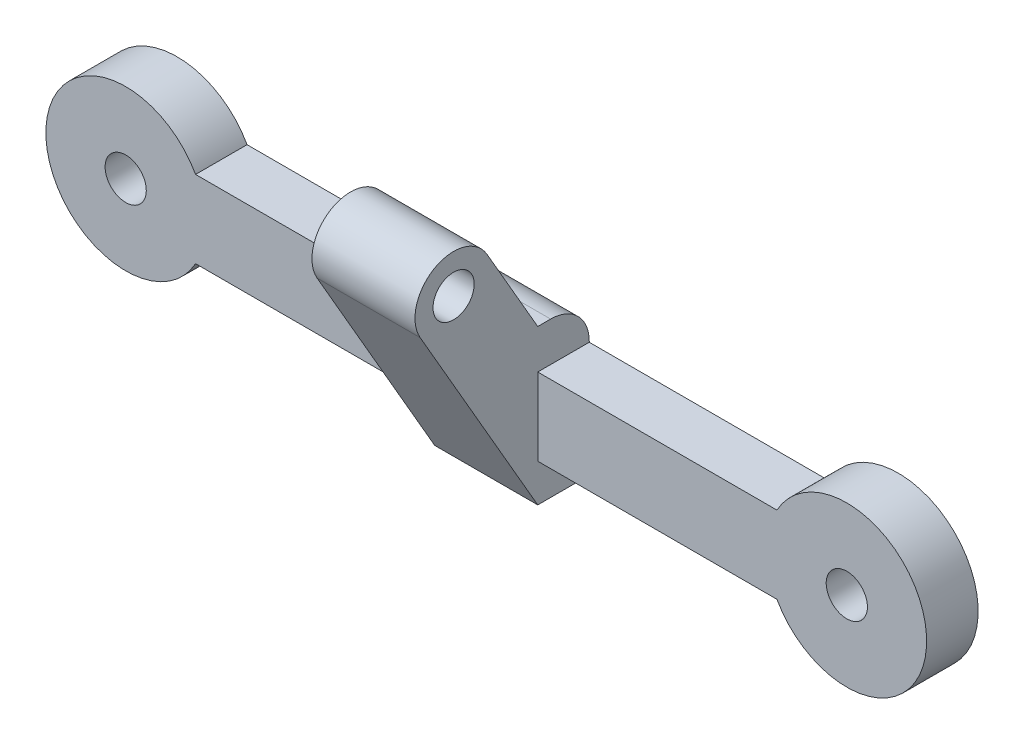
ISO-10303-21;
HEADER;
FILE_DESCRIPTION(('STEP AP214'),'2;1');
FILE_NAME('part.step','',(''),(''),'','','');
FILE_SCHEMA(('AUTOMOTIVE_DESIGN { 1 0 10303 214 1 1 1 1 }'));
ENDSEC;
DATA;
#1=APPLICATION_CONTEXT('core data for automotive mechanical design processes');
#2=APPLICATION_PROTOCOL_DEFINITION('international standard','automotive_design',2000,#1);
#3=PRODUCT_CONTEXT('',#1,'mechanical');
#4=PRODUCT('Part','Part','',(#3));
#5=PRODUCT_RELATED_PRODUCT_CATEGORY('part','',(#4));
#6=PRODUCT_DEFINITION_FORMATION('','',#4);
#7=PRODUCT_DEFINITION_CONTEXT('part definition',#1,'design');
#8=PRODUCT_DEFINITION('design','',#6,#7);
#9=PRODUCT_DEFINITION_SHAPE('','',#8);
#10=(LENGTH_UNIT() NAMED_UNIT(*) SI_UNIT(.MILLI.,.METRE.));
#11=(NAMED_UNIT(*) PLANE_ANGLE_UNIT() SI_UNIT($,.RADIAN.));
#12=(NAMED_UNIT(*) SI_UNIT($,.STERADIAN.) SOLID_ANGLE_UNIT());
#13=UNCERTAINTY_MEASURE_WITH_UNIT(LENGTH_MEASURE(1.E-05),#10,'distance_accuracy_value','');
#14=(GEOMETRIC_REPRESENTATION_CONTEXT(3) GLOBAL_UNCERTAINTY_ASSIGNED_CONTEXT((#13)) GLOBAL_UNIT_ASSIGNED_CONTEXT((#10,
#11,#12)) REPRESENTATION_CONTEXT('',''));
#15=CARTESIAN_POINT('',(0.,0.,0.));
#16=DIRECTION('',(0.,0.,1.));
#17=DIRECTION('',(1.,0.,0.));
#18=AXIS2_PLACEMENT_3D('',#15,#16,#17);
#19=CARTESIAN_POINT('',(56.,0.,4.));
#20=DIRECTION('',(0.,0.,1.));
#21=DIRECTION('',(1.,0.,0.));
#22=AXIS2_PLACEMENT_3D('',#19,#20,#21);
#23=PLANE('',#22);
#24=CARTESIAN_POINT('',(0.,0.,4.));
#25=DIRECTION('',(0.,0.,1.));
#26=DIRECTION('',(1.,0.,0.));
#27=AXIS2_PLACEMENT_3D('',#24,#25,#26);
#28=CIRCLE('',#27,1.6);
#29=CARTESIAN_POINT('',(1.6,0.,4.));
#30=VERTEX_POINT('',#29);
#31=EDGE_CURVE('E216',#30,#30,#28,.T.);
#32=ORIENTED_EDGE('',*,*,#31,.F.);
#33=EDGE_LOOP('',(#32));
#34=FACE_BOUND('',#33,.T.);
#35=DIRECTION('',(1.,0.,0.));
#36=VECTOR('',#35,1.);
#37=CARTESIAN_POINT('',(5.42586398650028,-3.,4.));
#38=LINE('',#37,#36);
#39=CARTESIAN_POINT('',(5.42586398650025,-2.99999999999999,4.));
#40=VERTEX_POINT('',#39);
#41=CARTESIAN_POINT('',(24.,-3.,4.));
#42=VERTEX_POINT('',#41);
#43=EDGE_CURVE('E233',#40,#42,#38,.T.);
#44=ORIENTED_EDGE('',*,*,#43,.T.);
#45=DIRECTION('',(0.,1.,0.));
#46=VECTOR('',#45,1.);
#47=CARTESIAN_POINT('',(24.,0.,4.));
#48=LINE('',#47,#46);
#49=CARTESIAN_POINT('',(24.,3.,4.));
#50=VERTEX_POINT('',#49);
#51=EDGE_CURVE('E204',#42,#50,#48,.T.);
#52=ORIENTED_EDGE('',*,*,#51,.T.);
#53=DIRECTION('',(-1.,0.,0.));
#54=VECTOR('',#53,1.);
#55=CARTESIAN_POINT('',(5.42586398650021,3.,4.));
#56=LINE('',#55,#54);
#57=CARTESIAN_POINT('',(5.42586398650021,3.,4.));
#58=VERTEX_POINT('',#57);
#59=EDGE_CURVE('E225',#50,#58,#56,.T.);
#60=ORIENTED_EDGE('',*,*,#59,.T.);
#61=CARTESIAN_POINT('',(0.,0.,4.));
#62=DIRECTION('',(0.,0.,1.));
#63=DIRECTION('',(1.,0.,0.));
#64=AXIS2_PLACEMENT_3D('',#61,#62,#63);
#65=CIRCLE('',#64,6.20000000000003);
#66=EDGE_CURVE('E230',#58,#40,#65,.T.);
#67=ORIENTED_EDGE('',*,*,#66,.T.);
#68=EDGE_LOOP('',(#44,#52,#60,#67));
#69=FACE_BOUND('',#68,.T.);
#70=ADVANCED_FACE('F33',(#34,#69),#23,.T.);
#71=CARTESIAN_POINT('',(5.42586398650021,3.,4.));
#72=DIRECTION('',(0.,-1.,0.));
#73=DIRECTION('',(0.,0.,-1.));
#74=AXIS2_PLACEMENT_3D('',#71,#72,#73);
#75=PLANE('',#74);
#76=DIRECTION('',(0.,0.,1.));
#77=VECTOR('',#76,1.);
#78=CARTESIAN_POINT('',(24.,3.,4.));
#79=LINE('',#78,#77);
#80=CARTESIAN_POINT('',(24.,3.,0.));
#81=VERTEX_POINT('',#80);
#82=EDGE_CURVE('E207',#81,#50,#79,.T.);
#83=ORIENTED_EDGE('',*,*,#82,.F.);
#84=DIRECTION('',(-1.,0.,0.));
#85=VECTOR('',#84,1.);
#86=CARTESIAN_POINT('',(5.42586398650021,3.,0.));
#87=LINE('',#86,#85);
#88=CARTESIAN_POINT('',(5.42586398650021,3.,0.));
#89=VERTEX_POINT('',#88);
#90=EDGE_CURVE('E239',#81,#89,#87,.T.);
#91=ORIENTED_EDGE('',*,*,#90,.T.);
#92=DIRECTION('',(0.,0.,-1.));
#93=VECTOR('',#92,1.);
#94=CARTESIAN_POINT('',(5.42586398650021,3.,4.));
#95=LINE('',#94,#93);
#96=EDGE_CURVE('E253',#58,#89,#95,.T.);
#97=ORIENTED_EDGE('',*,*,#96,.F.);
#98=ORIENTED_EDGE('',*,*,#59,.F.);
#99=EDGE_LOOP('',(#83,#91,#97,#98));
#100=FACE_BOUND('',#99,.T.);
#101=ADVANCED_FACE('F316',(#100),#75,.F.);
#102=CARTESIAN_POINT('',(5.42586398650028,-3.,4.));
#103=DIRECTION('',(0.,1.,0.));
#104=DIRECTION('',(0.,0.,1.));
#105=AXIS2_PLACEMENT_3D('',#102,#103,#104);
#106=PLANE('',#105);
#107=DIRECTION('',(0.,0.,-1.));
#108=VECTOR('',#107,1.);
#109=CARTESIAN_POINT('',(24.,-3.,4.));
#110=LINE('',#109,#108);
#111=CARTESIAN_POINT('',(24.,-3.,0.));
#112=VERTEX_POINT('',#111);
#113=EDGE_CURVE('E262',#42,#112,#110,.T.);
#114=ORIENTED_EDGE('',*,*,#113,.F.);
#115=ORIENTED_EDGE('',*,*,#43,.F.);
#116=DIRECTION('',(0.,0.,-1.));
#117=VECTOR('',#116,1.);
#118=CARTESIAN_POINT('',(5.42586398650025,-2.99999999999999,4.));
#119=LINE('',#118,#117);
#120=CARTESIAN_POINT('',(5.42586398650025,-2.99999999999999,0.));
#121=VERTEX_POINT('',#120);
#122=EDGE_CURVE('E250',#40,#121,#119,.T.);
#123=ORIENTED_EDGE('',*,*,#122,.T.);
#124=DIRECTION('',(1.,0.,0.));
#125=VECTOR('',#124,1.);
#126=CARTESIAN_POINT('',(5.42586398650028,-3.,0.));
#127=LINE('',#126,#125);
#128=EDGE_CURVE('E226',#121,#112,#127,.T.);
#129=ORIENTED_EDGE('',*,*,#128,.T.);
#130=EDGE_LOOP('',(#114,#115,#123,#129));
#131=FACE_BOUND('',#130,.T.);
#132=ADVANCED_FACE('F305',(#131),#106,.F.);
#133=DIRECTION('',(0.,1.,0.));
#134=VECTOR('',#133,1.);
#135=CARTESIAN_POINT('',(32.,0.,4.));
#136=LINE('',#135,#134);
#137=CARTESIAN_POINT('',(32.,-3.,4.));
#138=VERTEX_POINT('',#137);
#139=CARTESIAN_POINT('',(32.,3.,4.));
#140=VERTEX_POINT('',#139);
#141=EDGE_CURVE('E194',#138,#140,#136,.T.);
#142=ORIENTED_EDGE('',*,*,#141,.F.);
#143=CARTESIAN_POINT('',(50.5741360134999,-3.,4.));
#144=VERTEX_POINT('',#143);
#145=EDGE_CURVE('E232',#138,#144,#38,.T.);
#146=ORIENTED_EDGE('',*,*,#145,.T.);
#147=CARTESIAN_POINT('',(56.,0.,4.));
#148=DIRECTION('',(0.,0.,1.));
#149=DIRECTION('',(1.,0.,0.));
#150=AXIS2_PLACEMENT_3D('',#147,#148,#149);
#151=CIRCLE('',#150,6.19999999999997);
#152=CARTESIAN_POINT('',(50.5741360134998,3.,4.));
#153=VERTEX_POINT('',#152);
#154=EDGE_CURVE('E222',#144,#153,#151,.T.);
#155=ORIENTED_EDGE('',*,*,#154,.T.);
#156=EDGE_CURVE('E227',#153,#140,#56,.T.);
#157=ORIENTED_EDGE('',*,*,#156,.T.);
#158=EDGE_LOOP('',(#142,#146,#155,#157));
#159=FACE_BOUND('',#158,.T.);
#160=CARTESIAN_POINT('',(56.,0.,4.));
#161=DIRECTION('',(0.,0.,1.));
#162=DIRECTION('',(1.,0.,0.));
#163=AXIS2_PLACEMENT_3D('',#160,#161,#162);
#164=CIRCLE('',#163,1.6);
#165=CARTESIAN_POINT('',(57.6,0.,4.));
#166=VERTEX_POINT('',#165);
#167=EDGE_CURVE('E210',#166,#166,#164,.T.);
#168=ORIENTED_EDGE('',*,*,#167,.F.);
#169=EDGE_LOOP('',(#168));
#170=FACE_BOUND('',#169,.T.);
#171=ADVANCED_FACE('F280',(#159,#170),#23,.T.);
#172=CARTESIAN_POINT('',(56.,0.,0.));
#173=DIRECTION('',(0.,0.,1.));
#174=DIRECTION('',(1.,0.,0.));
#175=AXIS2_PLACEMENT_3D('',#172,#173,#174);
#176=PLANE('',#175);
#177=DIRECTION('',(0.,1.,0.));
#178=VECTOR('',#177,1.);
#179=CARTESIAN_POINT('',(24.,6.06020909748404,0.));
#180=LINE('',#179,#178);
#181=CARTESIAN_POINT('',(24.,3.06020909748404,0.));
#182=VERTEX_POINT('',#181);
#183=EDGE_CURVE('E187',#81,#182,#180,.T.);
#184=ORIENTED_EDGE('',*,*,#183,.T.);
#185=DIRECTION('',(1.,0.,0.));
#186=VECTOR('',#185,1.);
#187=CARTESIAN_POINT('',(32.,3.06020909748404,0.));
#188=LINE('',#187,#186);
#189=CARTESIAN_POINT('',(32.,3.06020909748404,0.));
#190=VERTEX_POINT('',#189);
#191=EDGE_CURVE('E264',#182,#190,#188,.T.);
#192=ORIENTED_EDGE('',*,*,#191,.T.);
#193=DIRECTION('',(0.,1.,0.));
#194=VECTOR('',#193,1.);
#195=CARTESIAN_POINT('',(32.,6.06020909748404,0.));
#196=LINE('',#195,#194);
#197=CARTESIAN_POINT('',(32.,3.,0.));
#198=VERTEX_POINT('',#197);
#199=EDGE_CURVE('E171',#198,#190,#196,.T.);
#200=ORIENTED_EDGE('',*,*,#199,.F.);
#201=CARTESIAN_POINT('',(50.5741360134998,3.,0.));
#202=VERTEX_POINT('',#201);
#203=EDGE_CURVE('E240',#202,#198,#87,.T.);
#204=ORIENTED_EDGE('',*,*,#203,.F.);
#205=CARTESIAN_POINT('',(56.,0.,0.));
#206=DIRECTION('',(0.,0.,1.));
#207=DIRECTION('',(1.,0.,0.));
#208=AXIS2_PLACEMENT_3D('',#205,#206,#207);
#209=CIRCLE('',#208,6.19999999999997);
#210=CARTESIAN_POINT('',(50.5741360134999,-3.,0.));
#211=VERTEX_POINT('',#210);
#212=EDGE_CURVE('E219',#211,#202,#209,.T.);
#213=ORIENTED_EDGE('',*,*,#212,.F.);
#214=CARTESIAN_POINT('',(32.,-3.,0.));
#215=VERTEX_POINT('',#214);
#216=EDGE_CURVE('E245',#215,#211,#127,.T.);
#217=ORIENTED_EDGE('',*,*,#216,.F.);
#218=CARTESIAN_POINT('',(32.,-5.93979090251594,0.));
#219=VERTEX_POINT('',#218);
#220=EDGE_CURVE('E172',#219,#215,#196,.T.);
#221=ORIENTED_EDGE('',*,*,#220,.F.);
#222=DIRECTION('',(1.,0.,0.));
#223=VECTOR('',#222,1.);
#224=CARTESIAN_POINT('',(24.,-5.93979090251594,0.));
#225=LINE('',#224,#223);
#226=CARTESIAN_POINT('',(24.,-5.93979090251594,0.));
#227=VERTEX_POINT('',#226);
#228=EDGE_CURVE('E195',#227,#219,#225,.T.);
#229=ORIENTED_EDGE('',*,*,#228,.F.);
#230=EDGE_CURVE('E188',#227,#112,#180,.T.);
#231=ORIENTED_EDGE('',*,*,#230,.T.);
#232=ORIENTED_EDGE('',*,*,#128,.F.);
#233=CARTESIAN_POINT('',(0.,0.,0.));
#234=DIRECTION('',(0.,0.,1.));
#235=DIRECTION('',(1.,0.,0.));
#236=AXIS2_PLACEMENT_3D('',#233,#234,#235);
#237=CIRCLE('',#236,6.20000000000003);
#238=EDGE_CURVE('E243',#89,#121,#237,.T.);
#239=ORIENTED_EDGE('',*,*,#238,.F.);
#240=ORIENTED_EDGE('',*,*,#90,.F.);
#241=EDGE_LOOP('',(#184,#192,#200,#204,#213,#217,#221,#229,#231,#232,#239,#240));
#242=FACE_BOUND('',#241,.T.);
#243=CARTESIAN_POINT('',(56.,0.,0.));
#244=DIRECTION('',(0.,0.,1.));
#245=DIRECTION('',(1.,0.,0.));
#246=AXIS2_PLACEMENT_3D('',#243,#244,#245);
#247=CIRCLE('',#246,1.6);
#248=CARTESIAN_POINT('',(57.6,0.,0.));
#249=VERTEX_POINT('',#248);
#250=EDGE_CURVE('E209',#249,#249,#247,.T.);
#251=ORIENTED_EDGE('',*,*,#250,.T.);
#252=EDGE_LOOP('',(#251));
#253=FACE_BOUND('',#252,.T.);
#254=CARTESIAN_POINT('',(0.,0.,0.));
#255=DIRECTION('',(0.,0.,1.));
#256=DIRECTION('',(1.,0.,0.));
#257=AXIS2_PLACEMENT_3D('',#254,#255,#256);
#258=CIRCLE('',#257,1.6);
#259=CARTESIAN_POINT('',(1.6,0.,0.));
#260=VERTEX_POINT('',#259);
#261=EDGE_CURVE('E213',#260,#260,#258,.T.);
#262=ORIENTED_EDGE('',*,*,#261,.T.);
#263=EDGE_LOOP('',(#262));
#264=FACE_BOUND('',#263,.T.);
#265=ADVANCED_FACE('F271',(#242,#253,#264),#176,.F.);
#266=CARTESIAN_POINT('',(56.,0.,4.));
#267=DIRECTION('',(0.,0.,-1.));
#268=DIRECTION('',(-1.,0.,0.));
#269=AXIS2_PLACEMENT_3D('',#266,#267,#268);
#270=CYLINDRICAL_SURFACE('',#269,6.19999999999997);
#271=ORIENTED_EDGE('',*,*,#212,.T.);
#272=DIRECTION('',(0.,0.,-1.));
#273=VECTOR('',#272,1.);
#274=CARTESIAN_POINT('',(50.5741360134998,3.,4.));
#275=LINE('',#274,#273);
#276=EDGE_CURVE('E256',#153,#202,#275,.T.);
#277=ORIENTED_EDGE('',*,*,#276,.F.);
#278=ORIENTED_EDGE('',*,*,#154,.F.);
#279=DIRECTION('',(0.,0.,-1.));
#280=VECTOR('',#279,1.);
#281=CARTESIAN_POINT('',(50.5741360134999,-3.,4.));
#282=LINE('',#281,#280);
#283=EDGE_CURVE('E236',#144,#211,#282,.T.);
#284=ORIENTED_EDGE('',*,*,#283,.T.);
#285=EDGE_LOOP('',(#271,#277,#278,#284));
#286=FACE_BOUND('',#285,.T.);
#287=ADVANCED_FACE('F287',(#286),#270,.T.);
#288=ORIENTED_EDGE('',*,*,#203,.T.);
#289=DIRECTION('',(0.,0.,1.));
#290=VECTOR('',#289,1.);
#291=CARTESIAN_POINT('',(32.,3.,4.));
#292=LINE('',#291,#290);
#293=EDGE_CURVE('E201',#198,#140,#292,.T.);
#294=ORIENTED_EDGE('',*,*,#293,.T.);
#295=ORIENTED_EDGE('',*,*,#156,.F.);
#296=ORIENTED_EDGE('',*,*,#276,.T.);
#297=EDGE_LOOP('',(#288,#294,#295,#296));
#298=FACE_BOUND('',#297,.T.);
#299=ADVANCED_FACE('F278',(#298),#75,.F.);
#300=CARTESIAN_POINT('',(0.,0.,4.));
#301=DIRECTION('',(0.,0.,-1.));
#302=DIRECTION('',(-1.,0.,0.));
#303=AXIS2_PLACEMENT_3D('',#300,#301,#302);
#304=CYLINDRICAL_SURFACE('',#303,6.20000000000003);
#305=ORIENTED_EDGE('',*,*,#238,.T.);
#306=ORIENTED_EDGE('',*,*,#122,.F.);
#307=ORIENTED_EDGE('',*,*,#66,.F.);
#308=ORIENTED_EDGE('',*,*,#96,.T.);
#309=EDGE_LOOP('',(#305,#306,#307,#308));
#310=FACE_BOUND('',#309,.T.);
#311=ADVANCED_FACE('F312',(#310),#304,.T.);
#312=ORIENTED_EDGE('',*,*,#145,.F.);
#313=DIRECTION('',(0.,0.,-1.));
#314=VECTOR('',#313,1.);
#315=CARTESIAN_POINT('',(32.,-3.,4.));
#316=LINE('',#315,#314);
#317=EDGE_CURVE('E259',#138,#215,#316,.T.);
#318=ORIENTED_EDGE('',*,*,#317,.T.);
#319=ORIENTED_EDGE('',*,*,#216,.T.);
#320=ORIENTED_EDGE('',*,*,#283,.F.);
#321=EDGE_LOOP('',(#312,#318,#319,#320));
#322=FACE_BOUND('',#321,.T.);
#323=ADVANCED_FACE('F292',(#322),#106,.F.);
#324=CARTESIAN_POINT('',(0.,0.,4.));
#325=DIRECTION('',(0.,0.,-1.));
#326=DIRECTION('',(-1.,0.,0.));
#327=AXIS2_PLACEMENT_3D('',#324,#325,#326);
#328=CYLINDRICAL_SURFACE('',#327,1.6);
#329=ORIENTED_EDGE('',*,*,#31,.T.);
#330=EDGE_LOOP('',(#329));
#331=FACE_BOUND('',#330,.T.);
#332=ORIENTED_EDGE('',*,*,#261,.F.);
#333=EDGE_LOOP('',(#332));
#334=FACE_BOUND('',#333,.T.);
#335=ADVANCED_FACE('F344',(#331,#334),#328,.F.);
#336=CARTESIAN_POINT('',(56.,0.,4.));
#337=DIRECTION('',(0.,0.,-1.));
#338=DIRECTION('',(-1.,0.,0.));
#339=AXIS2_PLACEMENT_3D('',#336,#337,#338);
#340=CYLINDRICAL_SURFACE('',#339,1.6);
#341=ORIENTED_EDGE('',*,*,#167,.T.);
#342=EDGE_LOOP('',(#341));
#343=FACE_BOUND('',#342,.T.);
#344=ORIENTED_EDGE('',*,*,#250,.F.);
#345=EDGE_LOOP('',(#344));
#346=FACE_BOUND('',#345,.T.);
#347=ADVANCED_FACE('F349',(#343,#346),#340,.F.);
#348=CARTESIAN_POINT('',(24.,11.3794294806591,10.5351549352428));
#349=DIRECTION('',(1.,0.,0.));
#350=DIRECTION('',(0.,0.,-1.));
#351=AXIS2_PLACEMENT_3D('',#348,#349,#350);
#352=PLANE('',#351);
#353=CARTESIAN_POINT('',(24.,11.3794294806591,10.5351549352428));
#354=DIRECTION('',(1.,0.,0.));
#355=DIRECTION('',(0.,0.,-1.));
#356=AXIS2_PLACEMENT_3D('',#353,#354,#355);
#357=CIRCLE('',#356,1.6);
#358=CARTESIAN_POINT('',(24.,11.3794294806591,8.93515493524283));
#359=VERTEX_POINT('',#358);
#360=EDGE_CURVE('E175',#359,#359,#357,.T.);
#361=ORIENTED_EDGE('',*,*,#360,.T.);
#362=EDGE_LOOP('',(#361));
#363=FACE_BOUND('',#362,.T.);
#364=DIRECTION('',(0.,0.,1.));
#365=VECTOR('',#364,1.);
#366=CARTESIAN_POINT('',(24.,6.06020909748404,4.));
#367=LINE('',#366,#365);
#368=CARTESIAN_POINT('',(24.,6.06020909748404,3.));
#369=VERTEX_POINT('',#368);
#370=CARTESIAN_POINT('',(24.,6.06020909748404,4.));
#371=VERTEX_POINT('',#370);
#372=EDGE_CURVE('E150',#369,#371,#367,.T.);
#373=ORIENTED_EDGE('',*,*,#372,.F.);
#374=CARTESIAN_POINT('',(24.,3.06020909748404,3.));
#375=DIRECTION('',(1.,0.,0.));
#376=DIRECTION('',(0.,0.,-1.));
#377=AXIS2_PLACEMENT_3D('',#374,#375,#376);
#378=CIRCLE('',#377,3.);
#379=EDGE_CURVE('E11',#369,#182,#378,.F.);
#380=ORIENTED_EDGE('',*,*,#379,.T.);
#381=ORIENTED_EDGE('',*,*,#183,.F.);
#382=ORIENTED_EDGE('',*,*,#82,.T.);
#383=ORIENTED_EDGE('',*,*,#51,.F.);
#384=ORIENTED_EDGE('',*,*,#113,.T.);
#385=ORIENTED_EDGE('',*,*,#230,.F.);
#386=DIRECTION('',(0.,0.,-1.));
#387=VECTOR('',#386,1.);
#388=CARTESIAN_POINT('',(24.,-5.93979090251594,4.00000000000001));
#389=LINE('',#388,#387);
#390=CARTESIAN_POINT('',(24.,-5.93979090251594,4.00000000000001));
#391=VERTEX_POINT('',#390);
#392=EDGE_CURVE('E184',#391,#227,#389,.T.);
#393=ORIENTED_EDGE('',*,*,#392,.F.);
#394=DIRECTION('',(0.,-0.866025403784439,-0.5));
#395=VECTOR('',#394,1.);
#396=CARTESIAN_POINT('',(24.,-5.93979090251594,4.00000000000001));
#397=LINE('',#396,#395);
#398=CARTESIAN_POINT('',(24.,9.87942948065912,13.1332311465962));
#399=VERTEX_POINT('',#398);
#400=EDGE_CURVE('E181',#399,#391,#397,.T.);
#401=ORIENTED_EDGE('',*,*,#400,.F.);
#402=CARTESIAN_POINT('',(24.,11.3794294806591,10.5351549352428));
#403=DIRECTION('',(1.,0.,0.));
#404=DIRECTION('',(0.,0.,-1.));
#405=AXIS2_PLACEMENT_3D('',#402,#403,#404);
#406=CIRCLE('',#405,3.);
#407=CARTESIAN_POINT('',(24.,12.8794294806591,7.93707872388952));
#408=VERTEX_POINT('',#407);
#409=EDGE_CURVE('E179',#408,#399,#406,.T.);
#410=ORIENTED_EDGE('',*,*,#409,.F.);
#411=DIRECTION('',(0.,0.866025403784439,0.5));
#412=VECTOR('',#411,1.);
#413=CARTESIAN_POINT('',(24.,6.06020909748404,4.));
#414=LINE('',#413,#412);
#415=EDGE_CURVE('E145',#371,#408,#414,.T.);
#416=ORIENTED_EDGE('',*,*,#415,.F.);
#417=EDGE_LOOP('',(#373,#380,#381,#382,#383,#384,#385,#393,#401,#410,#416));
#418=FACE_BOUND('',#417,.T.);
#419=ADVANCED_FACE('F300',(#363,#418),#352,.F.);
#420=CARTESIAN_POINT('',(32.,11.3794294806591,10.5351549352428));
#421=DIRECTION('',(1.,0.,0.));
#422=DIRECTION('',(0.,0.,-1.));
#423=AXIS2_PLACEMENT_3D('',#420,#421,#422);
#424=PLANE('',#423);
#425=CARTESIAN_POINT('',(32.,11.3794294806591,10.5351549352428));
#426=DIRECTION('',(1.,0.,0.));
#427=DIRECTION('',(0.,0.,-1.));
#428=AXIS2_PLACEMENT_3D('',#425,#426,#427);
#429=CIRCLE('',#428,1.6);
#430=CARTESIAN_POINT('',(32.,11.3794294806591,8.93515493524283));
#431=VERTEX_POINT('',#430);
#432=EDGE_CURVE('E162',#431,#431,#429,.T.);
#433=ORIENTED_EDGE('',*,*,#432,.F.);
#434=EDGE_LOOP('',(#433));
#435=FACE_BOUND('',#434,.T.);
#436=ORIENTED_EDGE('',*,*,#199,.T.);
#437=CARTESIAN_POINT('',(32.,3.06020909748404,3.));
#438=DIRECTION('',(1.,0.,0.));
#439=DIRECTION('',(0.,0.,-1.));
#440=AXIS2_PLACEMENT_3D('',#437,#438,#439);
#441=CIRCLE('',#440,3.);
#442=CARTESIAN_POINT('',(32.,6.06020909748404,3.));
#443=VERTEX_POINT('',#442);
#444=EDGE_CURVE('E55',#190,#443,#441,.T.);
#445=ORIENTED_EDGE('',*,*,#444,.T.);
#446=DIRECTION('',(0.,0.,1.));
#447=VECTOR('',#446,1.);
#448=CARTESIAN_POINT('',(32.,6.06020909748404,4.));
#449=LINE('',#448,#447);
#450=CARTESIAN_POINT('',(32.,6.06020909748404,4.));
#451=VERTEX_POINT('',#450);
#452=EDGE_CURVE('E160',#443,#451,#449,.T.);
#453=ORIENTED_EDGE('',*,*,#452,.T.);
#454=DIRECTION('',(0.,0.866025403784439,0.5));
#455=VECTOR('',#454,1.);
#456=CARTESIAN_POINT('',(32.,6.06020909748404,4.));
#457=LINE('',#456,#455);
#458=CARTESIAN_POINT('',(32.,12.8794294806591,7.93707872388952));
#459=VERTEX_POINT('',#458);
#460=EDGE_CURVE('E143',#451,#459,#457,.T.);
#461=ORIENTED_EDGE('',*,*,#460,.T.);
#462=CARTESIAN_POINT('',(32.,11.3794294806591,10.5351549352428));
#463=DIRECTION('',(1.,0.,0.));
#464=DIRECTION('',(0.,0.,-1.));
#465=AXIS2_PLACEMENT_3D('',#462,#463,#464);
#466=CIRCLE('',#465,3.);
#467=CARTESIAN_POINT('',(32.,9.87942948065912,13.1332311465962));
#468=VERTEX_POINT('',#467);
#469=EDGE_CURVE('E153',#459,#468,#466,.T.);
#470=ORIENTED_EDGE('',*,*,#469,.T.);
#471=DIRECTION('',(0.,-0.866025403784439,-0.5));
#472=VECTOR('',#471,1.);
#473=CARTESIAN_POINT('',(32.,-5.93979090251594,4.00000000000001));
#474=LINE('',#473,#472);
#475=CARTESIAN_POINT('',(32.,-5.93979090251594,4.00000000000001));
#476=VERTEX_POINT('',#475);
#477=EDGE_CURVE('E157',#468,#476,#474,.T.);
#478=ORIENTED_EDGE('',*,*,#477,.T.);
#479=DIRECTION('',(0.,0.,-1.));
#480=VECTOR('',#479,1.);
#481=CARTESIAN_POINT('',(32.,-5.93979090251594,4.00000000000001));
#482=LINE('',#481,#480);
#483=EDGE_CURVE('E168',#476,#219,#482,.T.);
#484=ORIENTED_EDGE('',*,*,#483,.T.);
#485=ORIENTED_EDGE('',*,*,#220,.T.);
#486=ORIENTED_EDGE('',*,*,#317,.F.);
#487=ORIENTED_EDGE('',*,*,#141,.T.);
#488=ORIENTED_EDGE('',*,*,#293,.F.);
#489=EDGE_LOOP('',(#436,#445,#453,#461,#470,#478,#484,#485,#486,#487,#488));
#490=FACE_BOUND('',#489,.T.);
#491=ADVANCED_FACE('F159',(#435,#490),#424,.T.);
#492=CARTESIAN_POINT('',(24.,6.06020909748404,4.));
#493=DIRECTION('',(0.,0.5,-0.866025403784439));
#494=DIRECTION('',(0.,0.866025403784439,0.5));
#495=AXIS2_PLACEMENT_3D('',#492,#493,#494);
#496=PLANE('',#495);
#497=DIRECTION('',(1.,0.,0.));
#498=VECTOR('',#497,1.);
#499=CARTESIAN_POINT('',(24.,12.8794294806591,7.93707872388952));
#500=LINE('',#499,#498);
#501=EDGE_CURVE('E138',#408,#459,#500,.T.);
#502=ORIENTED_EDGE('',*,*,#501,.T.);
#503=ORIENTED_EDGE('',*,*,#460,.F.);
#504=DIRECTION('',(1.,0.,0.));
#505=VECTOR('',#504,1.);
#506=CARTESIAN_POINT('',(24.,6.06020909748404,4.));
#507=LINE('',#506,#505);
#508=EDGE_CURVE('E192',#371,#451,#507,.T.);
#509=ORIENTED_EDGE('',*,*,#508,.F.);
#510=ORIENTED_EDGE('',*,*,#415,.T.);
#511=EDGE_LOOP('',(#502,#503,#509,#510));
#512=FACE_BOUND('',#511,.T.);
#513=ADVANCED_FACE('F140',(#512),#496,.T.);
#514=CARTESIAN_POINT('',(24.,6.06020909748404,4.));
#515=DIRECTION('',(0.,1.,0.));
#516=DIRECTION('',(0.,0.,1.));
#517=AXIS2_PLACEMENT_3D('',#514,#515,#516);
#518=PLANE('',#517);
#519=ORIENTED_EDGE('',*,*,#452,.F.);
#520=DIRECTION('',(1.,0.,0.));
#521=VECTOR('',#520,1.);
#522=CARTESIAN_POINT('',(24.,6.06020909748404,3.));
#523=LINE('',#522,#521);
#524=EDGE_CURVE('E41',#443,#369,#523,.F.);
#525=ORIENTED_EDGE('',*,*,#524,.T.);
#526=ORIENTED_EDGE('',*,*,#372,.T.);
#527=ORIENTED_EDGE('',*,*,#508,.T.);
#528=EDGE_LOOP('',(#519,#525,#526,#527));
#529=FACE_BOUND('',#528,.T.);
#530=ADVANCED_FACE('F380',(#529),#518,.T.);
#531=CARTESIAN_POINT('',(24.,-5.93979090251594,4.00000000000001));
#532=DIRECTION('',(0.,-1.,0.));
#533=DIRECTION('',(0.,0.,-1.));
#534=AXIS2_PLACEMENT_3D('',#531,#532,#533);
#535=PLANE('',#534);
#536=ORIENTED_EDGE('',*,*,#228,.T.);
#537=ORIENTED_EDGE('',*,*,#483,.F.);
#538=DIRECTION('',(1.,0.,0.));
#539=VECTOR('',#538,1.);
#540=CARTESIAN_POINT('',(24.,-5.93979090251594,4.00000000000001));
#541=LINE('',#540,#539);
#542=EDGE_CURVE('E197',#391,#476,#541,.T.);
#543=ORIENTED_EDGE('',*,*,#542,.F.);
#544=ORIENTED_EDGE('',*,*,#392,.T.);
#545=EDGE_LOOP('',(#536,#537,#543,#544));
#546=FACE_BOUND('',#545,.T.);
#547=ADVANCED_FACE('F295',(#546),#535,.T.);
#548=CARTESIAN_POINT('',(24.,-5.93979090251594,4.00000000000001));
#549=DIRECTION('',(0.,-0.5,0.866025403784439));
#550=DIRECTION('',(0.,-0.866025403784439,-0.5));
#551=AXIS2_PLACEMENT_3D('',#548,#549,#550);
#552=PLANE('',#551);
#553=ORIENTED_EDGE('',*,*,#542,.T.);
#554=ORIENTED_EDGE('',*,*,#477,.F.);
#555=DIRECTION('',(1.,0.,0.));
#556=VECTOR('',#555,1.);
#557=CARTESIAN_POINT('',(24.,9.87942948065912,13.1332311465962));
#558=LINE('',#557,#556);
#559=EDGE_CURVE('E149',#399,#468,#558,.T.);
#560=ORIENTED_EDGE('',*,*,#559,.F.);
#561=ORIENTED_EDGE('',*,*,#400,.T.);
#562=EDGE_LOOP('',(#553,#554,#560,#561));
#563=FACE_BOUND('',#562,.T.);
#564=ADVANCED_FACE('F393',(#563),#552,.T.);
#565=CARTESIAN_POINT('',(24.,11.3794294806591,10.5351549352428));
#566=DIRECTION('',(1.,0.,0.));
#567=DIRECTION('',(0.,0.,-1.));
#568=AXIS2_PLACEMENT_3D('',#565,#566,#567);
#569=CYLINDRICAL_SURFACE('',#568,3.);
#570=ORIENTED_EDGE('',*,*,#559,.T.);
#571=ORIENTED_EDGE('',*,*,#469,.F.);
#572=ORIENTED_EDGE('',*,*,#501,.F.);
#573=ORIENTED_EDGE('',*,*,#409,.T.);
#574=EDGE_LOOP('',(#570,#571,#572,#573));
#575=FACE_BOUND('',#574,.T.);
#576=ADVANCED_FACE('F154',(#575),#569,.T.);
#577=CARTESIAN_POINT('',(24.,11.3794294806591,10.5351549352428));
#578=DIRECTION('',(1.,0.,0.));
#579=DIRECTION('',(0.,0.,-1.));
#580=AXIS2_PLACEMENT_3D('',#577,#578,#579);
#581=CYLINDRICAL_SURFACE('',#580,1.6);
#582=ORIENTED_EDGE('',*,*,#360,.F.);
#583=EDGE_LOOP('',(#582));
#584=FACE_BOUND('',#583,.T.);
#585=ORIENTED_EDGE('',*,*,#432,.T.);
#586=EDGE_LOOP('',(#585));
#587=FACE_BOUND('',#586,.T.);
#588=ADVANCED_FACE('F318',(#584,#587),#581,.F.);
#589=CARTESIAN_POINT('',(56.,3.06020909748404,3.));
#590=DIRECTION('',(-1.,0.,0.));
#591=DIRECTION('',(0.,0.,1.));
#592=AXIS2_PLACEMENT_3D('',#589,#590,#591);
#593=CYLINDRICAL_SURFACE('',#592,3.);
#594=ORIENTED_EDGE('',*,*,#379,.F.);
#595=ORIENTED_EDGE('',*,*,#524,.F.);
#596=ORIENTED_EDGE('',*,*,#444,.F.);
#597=ORIENTED_EDGE('',*,*,#191,.F.);
#598=EDGE_LOOP('',(#594,#595,#596,#597));
#599=FACE_BOUND('',#598,.T.);
#600=ADVANCED_FACE('F35',(#599),#593,.T.);
#601=CLOSED_SHELL('',(#70,#101,#132,#171,#265,#287,#299,#311,#323,#335,#347,#419,#491,#513,#530,
#547,#564,#576,#588,#600));
#602=MANIFOLD_SOLID_BREP('B2',#601);
#603=ADVANCED_BREP_SHAPE_REPRESENTATION('',(#18,#602),#14);
#604=SHAPE_DEFINITION_REPRESENTATION(#9,#603);
ENDSEC;
END-ISO-10303-21;
